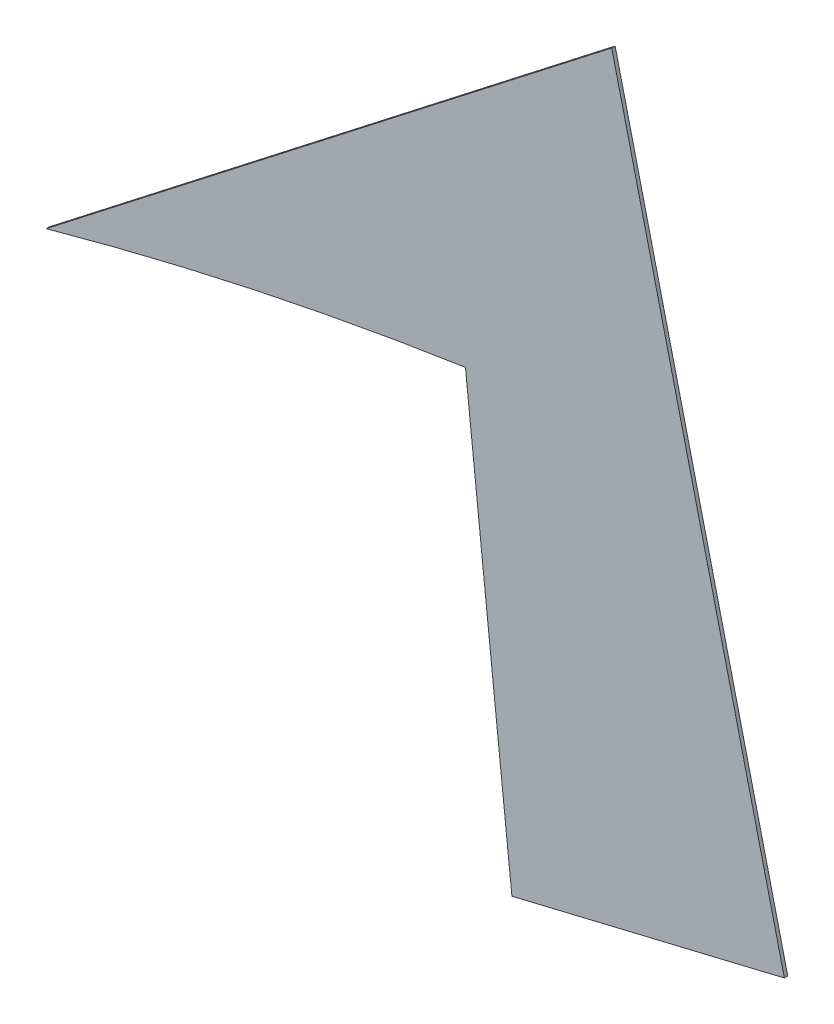
ISO-10303-21;
HEADER;
FILE_DESCRIPTION(('STEP AP214'),'2;1');
FILE_NAME('part.step','',(''),(''),'','','');
FILE_SCHEMA(('AUTOMOTIVE_DESIGN { 1 0 10303 214 1 1 1 1 }'));
ENDSEC;
DATA;
#1=APPLICATION_CONTEXT('core data for automotive mechanical design processes');
#2=APPLICATION_PROTOCOL_DEFINITION('international standard','automotive_design',2000,#1);
#3=PRODUCT_CONTEXT('',#1,'mechanical');
#4=PRODUCT('Part','Part','',(#3));
#5=PRODUCT_RELATED_PRODUCT_CATEGORY('part','',(#4));
#6=PRODUCT_DEFINITION_FORMATION('','',#4);
#7=PRODUCT_DEFINITION_CONTEXT('part definition',#1,'design');
#8=PRODUCT_DEFINITION('design','',#6,#7);
#9=PRODUCT_DEFINITION_SHAPE('','',#8);
#10=(LENGTH_UNIT() NAMED_UNIT(*) SI_UNIT(.MILLI.,.METRE.));
#11=(NAMED_UNIT(*) PLANE_ANGLE_UNIT() SI_UNIT($,.RADIAN.));
#12=(NAMED_UNIT(*) SI_UNIT($,.STERADIAN.) SOLID_ANGLE_UNIT());
#13=UNCERTAINTY_MEASURE_WITH_UNIT(LENGTH_MEASURE(1.E-05),#10,'distance_accuracy_value','');
#14=(GEOMETRIC_REPRESENTATION_CONTEXT(3) GLOBAL_UNCERTAINTY_ASSIGNED_CONTEXT((#13)) GLOBAL_UNIT_ASSIGNED_CONTEXT((#10,
#11,#12)) REPRESENTATION_CONTEXT('',''));
#15=CARTESIAN_POINT('',(0.,0.,0.));
#16=DIRECTION('',(0.,0.,1.));
#17=DIRECTION('',(1.,0.,0.));
#18=AXIS2_PLACEMENT_3D('',#15,#16,#17);
#19=CARTESIAN_POINT('',(30.7068916071306,-81.4038849932265,0.1));
#20=DIRECTION('',(0.,0.,-1.));
#21=DIRECTION('',(-1.,0.,0.));
#22=AXIS2_PLACEMENT_3D('',#19,#20,#21);
#23=CYLINDRICAL_SURFACE('',#22,103.79169731775);
#24=CARTESIAN_POINT('',(30.7068916071306,-81.4038849932265,0.));
#25=DIRECTION('',(0.,0.,-1.));
#26=DIRECTION('',(1.,0.,0.));
#27=AXIS2_PLACEMENT_3D('',#24,#25,#26);
#28=CIRCLE('',#27,103.79169731775);
#29=CARTESIAN_POINT('',(2.9336057529605,18.6029199000501,0.));
#30=VERTEX_POINT('',#29);
#31=CARTESIAN_POINT('',(15.2236739770585,21.2264536202613,0.));
#32=VERTEX_POINT('',#31);
#33=EDGE_CURVE('E107',#30,#32,#28,.T.);
#34=ORIENTED_EDGE('',*,*,#33,.T.);
#35=DIRECTION('',(0.,0.,-1.));
#36=VECTOR('',#35,1.);
#37=CARTESIAN_POINT('',(15.2236739770585,21.2264536202613,0.1));
#38=LINE('',#37,#36);
#39=CARTESIAN_POINT('',(15.2236739770585,21.2264536202613,0.1));
#40=VERTEX_POINT('',#39);
#41=EDGE_CURVE('E11',#40,#32,#38,.T.);
#42=ORIENTED_EDGE('',*,*,#41,.F.);
#43=CARTESIAN_POINT('',(30.7068916071306,-81.4038849932265,0.1));
#44=DIRECTION('',(0.,0.,-1.));
#45=DIRECTION('',(1.,0.,0.));
#46=AXIS2_PLACEMENT_3D('',#43,#44,#45);
#47=CIRCLE('',#46,103.79169731775);
#48=CARTESIAN_POINT('',(2.9336057529605,18.6029199000501,0.1));
#49=VERTEX_POINT('',#48);
#50=EDGE_CURVE('E115',#49,#40,#47,.T.);
#51=ORIENTED_EDGE('',*,*,#50,.F.);
#52=DIRECTION('',(0.,0.,-1.));
#53=VECTOR('',#52,1.);
#54=CARTESIAN_POINT('',(2.9336057529605,18.6029199000501,0.1));
#55=LINE('',#54,#53);
#56=EDGE_CURVE('E103',#49,#30,#55,.T.);
#57=ORIENTED_EDGE('',*,*,#56,.T.);
#58=EDGE_LOOP('',(#34,#42,#51,#57));
#59=FACE_BOUND('',#58,.T.);
#60=ADVANCED_FACE('F33',(#59),#23,.F.);
#61=CARTESIAN_POINT('',(16.5860593290045,8.48039401672179,0.1));
#62=DIRECTION('',(0.99433609317819,0.106281389730907,0.));
#63=DIRECTION('',(-0.106281389730907,0.994336093178191,0.));
#64=AXIS2_PLACEMENT_3D('',#61,#62,#63);
#65=PLANE('',#64);
#66=DIRECTION('',(0.106281389730907,-0.99433609317819,0.));
#67=VECTOR('',#66,1.);
#68=CARTESIAN_POINT('',(16.5860593290045,8.48039401672179,0.));
#69=LINE('',#68,#67);
#70=CARTESIAN_POINT('',(16.5860593290045,8.48039401672179,0.));
#71=VERTEX_POINT('',#70);
#72=EDGE_CURVE('E110',#32,#71,#69,.T.);
#73=ORIENTED_EDGE('',*,*,#72,.T.);
#74=DIRECTION('',(0.,0.,-1.));
#75=VECTOR('',#74,1.);
#76=CARTESIAN_POINT('',(16.5860593290045,8.48039401672179,0.1));
#77=LINE('',#76,#75);
#78=CARTESIAN_POINT('',(16.5860593290045,8.48039401672179,0.1));
#79=VERTEX_POINT('',#78);
#80=EDGE_CURVE('E41',#79,#71,#77,.T.);
#81=ORIENTED_EDGE('',*,*,#80,.F.);
#82=DIRECTION('',(0.106281389730907,-0.99433609317819,0.));
#83=VECTOR('',#82,1.);
#84=CARTESIAN_POINT('',(16.5860593290045,8.48039401672179,0.1));
#85=LINE('',#84,#83);
#86=EDGE_CURVE('E83',#40,#79,#85,.T.);
#87=ORIENTED_EDGE('',*,*,#86,.F.);
#88=ORIENTED_EDGE('',*,*,#41,.T.);
#89=EDGE_LOOP('',(#73,#81,#87,#88));
#90=FACE_BOUND('',#89,.T.);
#91=ADVANCED_FACE('F134',(#90),#65,.F.);
#92=CARTESIAN_POINT('',(24.5734925948328,10.3977878235372,0.1));
#93=DIRECTION('',(-0.233420126111624,0.972375979097609,0.));
#94=DIRECTION('',(-0.972375979097609,-0.233420126111624,0.));
#95=AXIS2_PLACEMENT_3D('',#92,#93,#94);
#96=PLANE('',#95);
#97=DIRECTION('',(0.972375979097609,0.233420126111624,0.));
#98=VECTOR('',#97,1.);
#99=CARTESIAN_POINT('',(24.5734925948328,10.3977878235372,0.));
#100=LINE('',#99,#98);
#101=CARTESIAN_POINT('',(24.5734925948328,10.3977878235372,0.));
#102=VERTEX_POINT('',#101);
#103=EDGE_CURVE('E98',#71,#102,#100,.T.);
#104=ORIENTED_EDGE('',*,*,#103,.T.);
#105=DIRECTION('',(0.,0.,-1.));
#106=VECTOR('',#105,1.);
#107=CARTESIAN_POINT('',(24.5734925948328,10.3977878235372,0.1));
#108=LINE('',#107,#106);
#109=CARTESIAN_POINT('',(24.5734925948328,10.3977878235372,0.1));
#110=VERTEX_POINT('',#109);
#111=EDGE_CURVE('E95',#110,#102,#108,.T.);
#112=ORIENTED_EDGE('',*,*,#111,.F.);
#113=DIRECTION('',(0.972375979097609,0.233420126111624,0.));
#114=VECTOR('',#113,1.);
#115=CARTESIAN_POINT('',(24.5734925948328,10.3977878235372,0.1));
#116=LINE('',#115,#114);
#117=EDGE_CURVE('E87',#79,#110,#116,.T.);
#118=ORIENTED_EDGE('',*,*,#117,.F.);
#119=ORIENTED_EDGE('',*,*,#80,.T.);
#120=EDGE_LOOP('',(#104,#112,#118,#119));
#121=FACE_BOUND('',#120,.T.);
#122=ADVANCED_FACE('F96',(#121),#96,.F.);
#123=CARTESIAN_POINT('',(19.5125853921047,31.4803940167218,0.1));
#124=DIRECTION('',(-0.972375979097609,-0.233420126111626,0.));
#125=DIRECTION('',(0.233420126111626,-0.972375979097608,0.));
#126=AXIS2_PLACEMENT_3D('',#123,#124,#125);
#127=PLANE('',#126);
#128=DIRECTION('',(-0.233420126111626,0.972375979097609,0.));
#129=VECTOR('',#128,1.);
#130=CARTESIAN_POINT('',(19.5125853921047,31.4803940167218,0.));
#131=LINE('',#130,#129);
#132=CARTESIAN_POINT('',(19.5125853921047,31.4803940167218,0.));
#133=VERTEX_POINT('',#132);
#134=EDGE_CURVE('E69',#102,#133,#131,.T.);
#135=ORIENTED_EDGE('',*,*,#134,.T.);
#136=DIRECTION('',(0.,0.,-1.));
#137=VECTOR('',#136,1.);
#138=CARTESIAN_POINT('',(19.5125853921047,31.4803940167218,0.1));
#139=LINE('',#138,#137);
#140=CARTESIAN_POINT('',(19.5125853921047,31.4803940167218,0.1));
#141=VERTEX_POINT('',#140);
#142=EDGE_CURVE('E99',#141,#133,#139,.T.);
#143=ORIENTED_EDGE('',*,*,#142,.F.);
#144=DIRECTION('',(-0.233420126111626,0.972375979097609,0.));
#145=VECTOR('',#144,1.);
#146=CARTESIAN_POINT('',(19.5125853921047,31.4803940167218,0.1));
#147=LINE('',#146,#145);
#148=EDGE_CURVE('E91',#110,#141,#147,.T.);
#149=ORIENTED_EDGE('',*,*,#148,.F.);
#150=ORIENTED_EDGE('',*,*,#111,.T.);
#151=EDGE_LOOP('',(#135,#143,#149,#150));
#152=FACE_BOUND('',#151,.T.);
#153=ADVANCED_FACE('F101',(#152),#127,.F.);
#154=CARTESIAN_POINT('',(2.9336057529605,18.6029199000501,0.1));
#155=DIRECTION('',(0.613427369069024,-0.789751139839035,0.));
#156=DIRECTION('',(0.789751139839035,0.613427369069024,0.));
#157=AXIS2_PLACEMENT_3D('',#154,#155,#156);
#158=PLANE('',#157);
#159=DIRECTION('',(-0.789751139839035,-0.613427369069024,0.));
#160=VECTOR('',#159,1.);
#161=CARTESIAN_POINT('',(2.9336057529605,18.6029199000501,0.));
#162=LINE('',#161,#160);
#163=EDGE_CURVE('E75',#133,#30,#162,.T.);
#164=ORIENTED_EDGE('',*,*,#163,.T.);
#165=ORIENTED_EDGE('',*,*,#56,.F.);
#166=DIRECTION('',(-0.789751139839035,-0.613427369069024,0.));
#167=VECTOR('',#166,1.);
#168=CARTESIAN_POINT('',(2.9336057529605,18.6029199000501,0.1));
#169=LINE('',#168,#167);
#170=EDGE_CURVE('E49',#141,#49,#169,.T.);
#171=ORIENTED_EDGE('',*,*,#170,.F.);
#172=ORIENTED_EDGE('',*,*,#142,.T.);
#173=EDGE_LOOP('',(#164,#165,#171,#172));
#174=FACE_BOUND('',#173,.T.);
#175=ADVANCED_FACE('F123',(#174),#158,.F.);
#176=CARTESIAN_POINT('',(30.7068916071306,-81.4038849932265,0.1));
#177=DIRECTION('',(0.,0.,1.));
#178=DIRECTION('',(1.,0.,0.));
#179=AXIS2_PLACEMENT_3D('',#176,#177,#178);
#180=PLANE('',#179);
#181=ORIENTED_EDGE('',*,*,#50,.T.);
#182=ORIENTED_EDGE('',*,*,#86,.T.);
#183=ORIENTED_EDGE('',*,*,#117,.T.);
#184=ORIENTED_EDGE('',*,*,#148,.T.);
#185=ORIENTED_EDGE('',*,*,#170,.T.);
#186=EDGE_LOOP('',(#181,#182,#183,#184,#185));
#187=FACE_BOUND('',#186,.T.);
#188=ADVANCED_FACE('F89',(#187),#180,.T.);
#189=CARTESIAN_POINT('',(30.7068916071306,-81.4038849932265,0.));
#190=DIRECTION('',(0.,0.,1.));
#191=DIRECTION('',(1.,0.,0.));
#192=AXIS2_PLACEMENT_3D('',#189,#190,#191);
#193=PLANE('',#192);
#194=ORIENTED_EDGE('',*,*,#33,.F.);
#195=ORIENTED_EDGE('',*,*,#163,.F.);
#196=ORIENTED_EDGE('',*,*,#134,.F.);
#197=ORIENTED_EDGE('',*,*,#103,.F.);
#198=ORIENTED_EDGE('',*,*,#72,.F.);
#199=EDGE_LOOP('',(#194,#195,#196,#197,#198));
#200=FACE_BOUND('',#199,.T.);
#201=ADVANCED_FACE('F119',(#200),#193,.F.);
#202=CLOSED_SHELL('',(#60,#91,#122,#153,#175,#188,#201));
#203=MANIFOLD_SOLID_BREP('B2',#202);
#204=ADVANCED_BREP_SHAPE_REPRESENTATION('',(#18,#203),#14);
#205=SHAPE_DEFINITION_REPRESENTATION(#9,#204);
ENDSEC;
END-ISO-10303-21;
